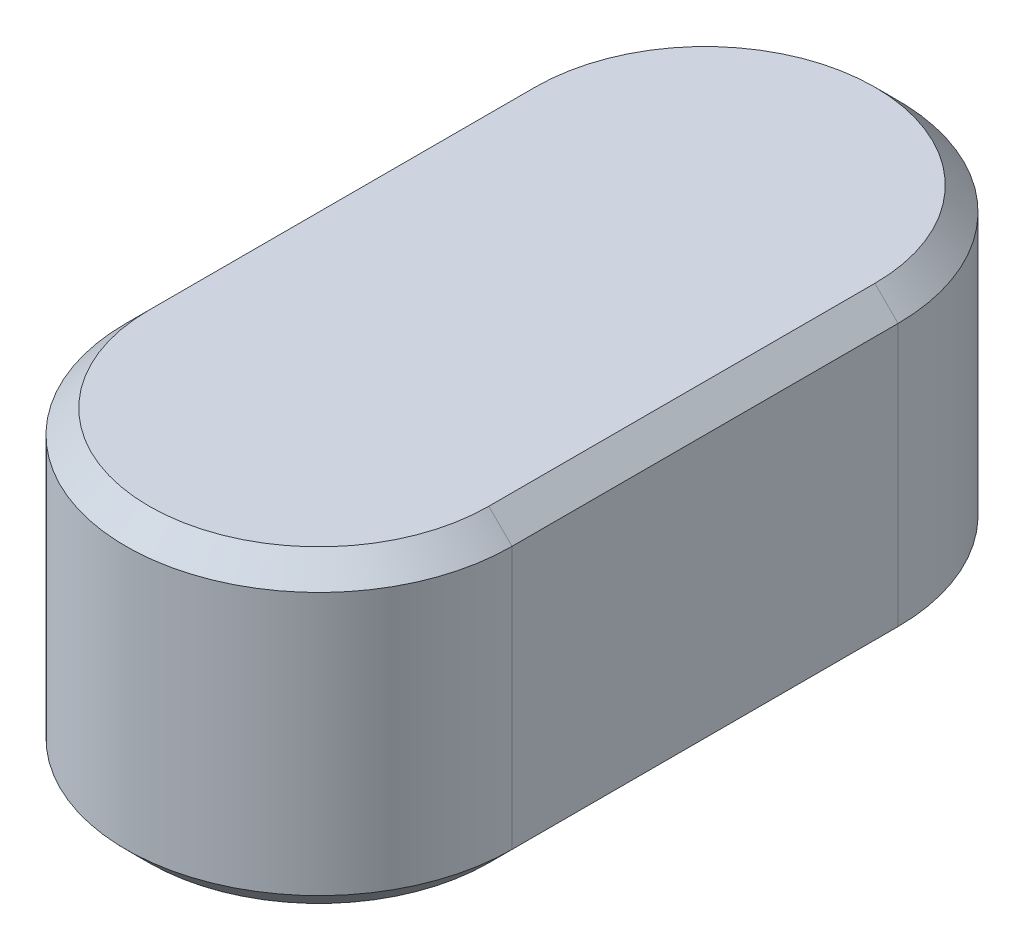
ISO-10303-21;
HEADER;
FILE_DESCRIPTION(('STEP AP214'),'2;1');
FILE_NAME('part.step','',(''),(''),'','','');
FILE_SCHEMA(('AUTOMOTIVE_DESIGN { 1 0 10303 214 1 1 1 1 }'));
ENDSEC;
DATA;
#1=APPLICATION_CONTEXT('core data for automotive mechanical design processes');
#2=APPLICATION_PROTOCOL_DEFINITION('international standard','automotive_design',2000,#1);
#3=PRODUCT_CONTEXT('',#1,'mechanical');
#4=PRODUCT('Part','Part','',(#3));
#5=PRODUCT_RELATED_PRODUCT_CATEGORY('part','',(#4));
#6=PRODUCT_DEFINITION_FORMATION('','',#4);
#7=PRODUCT_DEFINITION_CONTEXT('part definition',#1,'design');
#8=PRODUCT_DEFINITION('design','',#6,#7);
#9=PRODUCT_DEFINITION_SHAPE('','',#8);
#10=(LENGTH_UNIT() NAMED_UNIT(*) SI_UNIT(.MILLI.,.METRE.));
#11=(NAMED_UNIT(*) PLANE_ANGLE_UNIT() SI_UNIT($,.RADIAN.));
#12=(NAMED_UNIT(*) SI_UNIT($,.STERADIAN.) SOLID_ANGLE_UNIT());
#13=UNCERTAINTY_MEASURE_WITH_UNIT(LENGTH_MEASURE(1.E-05),#10,'distance_accuracy_value','');
#14=(GEOMETRIC_REPRESENTATION_CONTEXT(3) GLOBAL_UNCERTAINTY_ASSIGNED_CONTEXT((#13)) GLOBAL_UNIT_ASSIGNED_CONTEXT((#10,
#11,#12)) REPRESENTATION_CONTEXT('',''));
#15=CARTESIAN_POINT('',(0.,0.,0.));
#16=DIRECTION('',(0.,0.,1.));
#17=DIRECTION('',(1.,0.,0.));
#18=AXIS2_PLACEMENT_3D('',#15,#16,#17);
#19=CARTESIAN_POINT('',(0.,8.,0.));
#20=DIRECTION('',(0.,-1.,0.));
#21=DIRECTION('',(0.,0.,-1.));
#22=AXIS2_PLACEMENT_3D('',#19,#20,#21);
#23=CYLINDRICAL_SURFACE('',#22,5.);
#24=DIRECTION('',(0.,-1.,0.));
#25=VECTOR('',#24,1.);
#26=CARTESIAN_POINT('',(-5.,8.,0.));
#27=LINE('',#26,#25);
#28=CARTESIAN_POINT('',(-5.,7.4,0.));
#29=VERTEX_POINT('',#28);
#30=CARTESIAN_POINT('',(-5.,0.600000000000007,0.));
#31=VERTEX_POINT('',#30);
#32=EDGE_CURVE('E119',#29,#31,#27,.T.);
#33=ORIENTED_EDGE('',*,*,#32,.T.);
#34=CARTESIAN_POINT('',(0.,0.600000000000007,0.));
#35=DIRECTION('',(0.,-1.,0.));
#36=DIRECTION('',(0.,0.,-1.));
#37=AXIS2_PLACEMENT_3D('',#34,#35,#36);
#38=CIRCLE('',#37,5.);
#39=CARTESIAN_POINT('',(5.,0.600000000000007,0.));
#40=VERTEX_POINT('',#39);
#41=EDGE_CURVE('E126',#31,#40,#38,.F.);
#42=ORIENTED_EDGE('',*,*,#41,.T.);
#43=DIRECTION('',(0.,-1.,0.));
#44=VECTOR('',#43,1.);
#45=CARTESIAN_POINT('',(5.,8.,0.));
#46=LINE('',#45,#44);
#47=CARTESIAN_POINT('',(5.,7.4,0.));
#48=VERTEX_POINT('',#47);
#49=EDGE_CURVE('E121',#48,#40,#46,.T.);
#50=ORIENTED_EDGE('',*,*,#49,.F.);
#51=CARTESIAN_POINT('',(0.,7.4,0.));
#52=DIRECTION('',(0.,-1.,0.));
#53=DIRECTION('',(0.,0.,-1.));
#54=AXIS2_PLACEMENT_3D('',#51,#52,#53);
#55=CIRCLE('',#54,5.);
#56=EDGE_CURVE('E117',#48,#29,#55,.T.);
#57=ORIENTED_EDGE('',*,*,#56,.T.);
#58=EDGE_LOOP('',(#33,#42,#50,#57));
#59=FACE_BOUND('',#58,.T.);
#60=ADVANCED_FACE('F45',(#59),#23,.T.);
#61=CARTESIAN_POINT('',(5.,8.,0.));
#62=DIRECTION('',(-1.,0.,0.));
#63=DIRECTION('',(0.,0.,1.));
#64=AXIS2_PLACEMENT_3D('',#61,#62,#63);
#65=PLANE('',#64);
#66=ORIENTED_EDGE('',*,*,#49,.T.);
#67=DIRECTION('',(0.,0.,-1.));
#68=VECTOR('',#67,1.);
#69=CARTESIAN_POINT('',(5.,0.600000000000007,-10.));
#70=LINE('',#69,#68);
#71=CARTESIAN_POINT('',(5.,0.600000000000007,-10.));
#72=VERTEX_POINT('',#71);
#73=EDGE_CURVE('E192',#40,#72,#70,.T.);
#74=ORIENTED_EDGE('',*,*,#73,.T.);
#75=DIRECTION('',(0.,-1.,0.));
#76=VECTOR('',#75,1.);
#77=CARTESIAN_POINT('',(5.,8.,-10.));
#78=LINE('',#77,#76);
#79=CARTESIAN_POINT('',(5.,7.4,-10.));
#80=VERTEX_POINT('',#79);
#81=EDGE_CURVE('E233',#80,#72,#78,.T.);
#82=ORIENTED_EDGE('',*,*,#81,.F.);
#83=DIRECTION('',(0.,0.,1.));
#84=VECTOR('',#83,1.);
#85=CARTESIAN_POINT('',(5.,7.4,0.));
#86=LINE('',#85,#84);
#87=EDGE_CURVE('E214',#80,#48,#86,.T.);
#88=ORIENTED_EDGE('',*,*,#87,.T.);
#89=EDGE_LOOP('',(#66,#74,#82,#88));
#90=FACE_BOUND('',#89,.T.);
#91=ADVANCED_FACE('F235',(#90),#65,.F.);
#92=CARTESIAN_POINT('',(0.,8.,-10.));
#93=DIRECTION('',(0.,-1.,0.));
#94=DIRECTION('',(0.,0.,-1.));
#95=AXIS2_PLACEMENT_3D('',#92,#93,#94);
#96=CYLINDRICAL_SURFACE('',#95,5.);
#97=ORIENTED_EDGE('',*,*,#81,.T.);
#98=CARTESIAN_POINT('',(0.,0.600000000000007,-10.));
#99=DIRECTION('',(0.,-1.,0.));
#100=DIRECTION('',(0.,0.,-1.));
#101=AXIS2_PLACEMENT_3D('',#98,#99,#100);
#102=CIRCLE('',#101,5.);
#103=CARTESIAN_POINT('',(-5.,0.600000000000007,-10.));
#104=VERTEX_POINT('',#103);
#105=EDGE_CURVE('E187',#72,#104,#102,.F.);
#106=ORIENTED_EDGE('',*,*,#105,.T.);
#107=DIRECTION('',(0.,-1.,0.));
#108=VECTOR('',#107,1.);
#109=CARTESIAN_POINT('',(-5.,8.,-10.));
#110=LINE('',#109,#108);
#111=CARTESIAN_POINT('',(-5.,7.4,-10.));
#112=VERTEX_POINT('',#111);
#113=EDGE_CURVE('E139',#112,#104,#110,.T.);
#114=ORIENTED_EDGE('',*,*,#113,.F.);
#115=CARTESIAN_POINT('',(0.,7.4,-10.));
#116=DIRECTION('',(0.,-1.,0.));
#117=DIRECTION('',(0.,0.,-1.));
#118=AXIS2_PLACEMENT_3D('',#115,#116,#117);
#119=CIRCLE('',#118,5.);
#120=EDGE_CURVE('E209',#112,#80,#119,.T.);
#121=ORIENTED_EDGE('',*,*,#120,.T.);
#122=EDGE_LOOP('',(#97,#106,#114,#121));
#123=FACE_BOUND('',#122,.T.);
#124=ADVANCED_FACE('F232',(#123),#96,.T.);
#125=CARTESIAN_POINT('',(-5.,8.,0.));
#126=DIRECTION('',(1.,0.,0.));
#127=DIRECTION('',(0.,0.,-1.));
#128=AXIS2_PLACEMENT_3D('',#125,#126,#127);
#129=PLANE('',#128);
#130=ORIENTED_EDGE('',*,*,#113,.T.);
#131=DIRECTION('',(0.,0.,1.));
#132=VECTOR('',#131,1.);
#133=CARTESIAN_POINT('',(-5.,0.600000000000007,0.));
#134=LINE('',#133,#132);
#135=EDGE_CURVE('E137',#104,#31,#134,.T.);
#136=ORIENTED_EDGE('',*,*,#135,.T.);
#137=ORIENTED_EDGE('',*,*,#32,.F.);
#138=DIRECTION('',(0.,0.,-1.));
#139=VECTOR('',#138,1.);
#140=CARTESIAN_POINT('',(-5.,7.4,0.));
#141=LINE('',#140,#139);
#142=EDGE_CURVE('E134',#29,#112,#141,.T.);
#143=ORIENTED_EDGE('',*,*,#142,.T.);
#144=EDGE_LOOP('',(#130,#136,#137,#143));
#145=FACE_BOUND('',#144,.T.);
#146=ADVANCED_FACE('F133',(#145),#129,.F.);
#147=CARTESIAN_POINT('',(0.,8.,0.));
#148=DIRECTION('',(0.,-1.,0.));
#149=DIRECTION('',(0.,0.,-1.));
#150=AXIS2_PLACEMENT_3D('',#147,#148,#149);
#151=PLANE('',#150);
#152=CARTESIAN_POINT('',(0.,8.,-10.));
#153=DIRECTION('',(0.,-1.,0.));
#154=DIRECTION('',(0.,0.,-1.));
#155=AXIS2_PLACEMENT_3D('',#152,#153,#154);
#156=CIRCLE('',#155,4.4);
#157=CARTESIAN_POINT('',(4.4,8.,-10.));
#158=VERTEX_POINT('',#157);
#159=CARTESIAN_POINT('',(-4.4,8.,-10.));
#160=VERTEX_POINT('',#159);
#161=EDGE_CURVE('E71',#158,#160,#156,.F.);
#162=ORIENTED_EDGE('',*,*,#161,.T.);
#163=DIRECTION('',(0.,0.,1.));
#164=VECTOR('',#163,1.);
#165=CARTESIAN_POINT('',(-4.4,8.,0.));
#166=LINE('',#165,#164);
#167=CARTESIAN_POINT('',(-4.4,8.,0.));
#168=VERTEX_POINT('',#167);
#169=EDGE_CURVE('E11',#160,#168,#166,.T.);
#170=ORIENTED_EDGE('',*,*,#169,.T.);
#171=CARTESIAN_POINT('',(0.,8.,0.));
#172=DIRECTION('',(0.,-1.,0.));
#173=DIRECTION('',(0.,0.,-1.));
#174=AXIS2_PLACEMENT_3D('',#171,#172,#173);
#175=CIRCLE('',#174,4.4);
#176=CARTESIAN_POINT('',(4.4,8.,0.));
#177=VERTEX_POINT('',#176);
#178=EDGE_CURVE('E56',#168,#177,#175,.F.);
#179=ORIENTED_EDGE('',*,*,#178,.T.);
#180=DIRECTION('',(0.,0.,-1.));
#181=VECTOR('',#180,1.);
#182=CARTESIAN_POINT('',(4.4,8.,0.));
#183=LINE('',#182,#181);
#184=EDGE_CURVE('E219',#177,#158,#183,.T.);
#185=ORIENTED_EDGE('',*,*,#184,.T.);
#186=EDGE_LOOP('',(#162,#170,#179,#185));
#187=FACE_BOUND('',#186,.T.);
#188=ADVANCED_FACE('F225',(#187),#151,.F.);
#189=CARTESIAN_POINT('',(0.,0.,0.));
#190=DIRECTION('',(0.,-1.,0.));
#191=DIRECTION('',(0.,0.,-1.));
#192=AXIS2_PLACEMENT_3D('',#189,#190,#191);
#193=PLANE('',#192);
#194=CARTESIAN_POINT('',(0.,0.,0.));
#195=DIRECTION('',(0.,-1.,0.));
#196=DIRECTION('',(0.,0.,-1.));
#197=AXIS2_PLACEMENT_3D('',#194,#195,#196);
#198=CIRCLE('',#197,4.39999999999999);
#199=CARTESIAN_POINT('',(4.39999999999999,0.,0.));
#200=VERTEX_POINT('',#199);
#201=CARTESIAN_POINT('',(-4.39999999999999,0.,0.));
#202=VERTEX_POINT('',#201);
#203=EDGE_CURVE('E199',#200,#202,#198,.T.);
#204=ORIENTED_EDGE('',*,*,#203,.T.);
#205=DIRECTION('',(0.,0.,-1.));
#206=VECTOR('',#205,1.);
#207=CARTESIAN_POINT('',(-4.39999999999999,0.,-10.));
#208=LINE('',#207,#206);
#209=CARTESIAN_POINT('',(-4.39999999999999,0.,-10.));
#210=VERTEX_POINT('',#209);
#211=EDGE_CURVE('E127',#202,#210,#208,.T.);
#212=ORIENTED_EDGE('',*,*,#211,.T.);
#213=CARTESIAN_POINT('',(0.,0.,-10.));
#214=DIRECTION('',(0.,-1.,0.));
#215=DIRECTION('',(0.,0.,-1.));
#216=AXIS2_PLACEMENT_3D('',#213,#214,#215);
#217=CIRCLE('',#216,4.39999999999999);
#218=CARTESIAN_POINT('',(4.39999999999999,0.,-10.));
#219=VERTEX_POINT('',#218);
#220=EDGE_CURVE('E185',#210,#219,#217,.T.);
#221=ORIENTED_EDGE('',*,*,#220,.T.);
#222=DIRECTION('',(0.,0.,1.));
#223=VECTOR('',#222,1.);
#224=CARTESIAN_POINT('',(4.39999999999999,0.,0.));
#225=LINE('',#224,#223);
#226=EDGE_CURVE('E193',#219,#200,#225,.T.);
#227=ORIENTED_EDGE('',*,*,#226,.T.);
#228=EDGE_LOOP('',(#204,#212,#221,#227));
#229=FACE_BOUND('',#228,.T.);
#230=ADVANCED_FACE('F263',(#229),#193,.T.);
#231=CARTESIAN_POINT('',(5.,0.600000000000007,0.));
#232=DIRECTION('',(0.707106781186547,-0.707106781186547,0.));
#233=DIRECTION('',(0.,0.,1.));
#234=AXIS2_PLACEMENT_3D('',#231,#232,#233);
#235=PLANE('',#234);
#236=DIRECTION('',(0.707106781186547,0.707106781186547,0.));
#237=VECTOR('',#236,1.);
#238=CARTESIAN_POINT('',(4.39999999999999,0.,0.));
#239=LINE('',#238,#237);
#240=EDGE_CURVE('E169',#200,#40,#239,.T.);
#241=ORIENTED_EDGE('',*,*,#240,.F.);
#242=ORIENTED_EDGE('',*,*,#226,.F.);
#243=DIRECTION('',(-0.707106781186547,-0.707106781186547,0.));
#244=VECTOR('',#243,1.);
#245=CARTESIAN_POINT('',(5.,0.600000000000007,-10.));
#246=LINE('',#245,#244);
#247=EDGE_CURVE('E140',#72,#219,#246,.T.);
#248=ORIENTED_EDGE('',*,*,#247,.F.);
#249=ORIENTED_EDGE('',*,*,#73,.F.);
#250=EDGE_LOOP('',(#241,#242,#248,#249));
#251=FACE_BOUND('',#250,.T.);
#252=ADVANCED_FACE('F191',(#251),#235,.T.);
#253=CARTESIAN_POINT('',(0.,0.600000000000007,-10.));
#254=DIRECTION('',(0.,1.,0.));
#255=DIRECTION('',(0.,0.,1.));
#256=AXIS2_PLACEMENT_3D('',#253,#254,#255);
#257=CONICAL_SURFACE('',#256,5.,0.785398163397448);
#258=ORIENTED_EDGE('',*,*,#247,.T.);
#259=ORIENTED_EDGE('',*,*,#220,.F.);
#260=DIRECTION('',(0.707106781186547,-0.707106781186547,0.));
#261=VECTOR('',#260,1.);
#262=CARTESIAN_POINT('',(-5.,0.600000000000007,-10.));
#263=LINE('',#262,#261);
#264=EDGE_CURVE('E162',#104,#210,#263,.T.);
#265=ORIENTED_EDGE('',*,*,#264,.F.);
#266=ORIENTED_EDGE('',*,*,#105,.F.);
#267=EDGE_LOOP('',(#258,#259,#265,#266));
#268=FACE_BOUND('',#267,.T.);
#269=ADVANCED_FACE('F183',(#268),#257,.T.);
#270=CARTESIAN_POINT('',(0.,0.600000000000007,0.));
#271=DIRECTION('',(0.,1.,0.));
#272=DIRECTION('',(0.,0.,1.));
#273=AXIS2_PLACEMENT_3D('',#270,#271,#272);
#274=CONICAL_SURFACE('',#273,5.,0.785398163397448);
#275=ORIENTED_EDGE('',*,*,#240,.T.);
#276=ORIENTED_EDGE('',*,*,#41,.F.);
#277=DIRECTION('',(-0.707106781186547,0.707106781186547,0.));
#278=VECTOR('',#277,1.);
#279=CARTESIAN_POINT('',(-4.39999999999999,0.,0.));
#280=LINE('',#279,#278);
#281=EDGE_CURVE('E158',#202,#31,#280,.T.);
#282=ORIENTED_EDGE('',*,*,#281,.F.);
#283=ORIENTED_EDGE('',*,*,#203,.F.);
#284=EDGE_LOOP('',(#275,#276,#282,#283));
#285=FACE_BOUND('',#284,.T.);
#286=ADVANCED_FACE('F244',(#285),#274,.T.);
#287=CARTESIAN_POINT('',(-5.,0.600000000000007,0.));
#288=DIRECTION('',(-0.707106781186547,-0.707106781186547,0.));
#289=DIRECTION('',(0.,0.,-1.));
#290=AXIS2_PLACEMENT_3D('',#287,#288,#289);
#291=PLANE('',#290);
#292=ORIENTED_EDGE('',*,*,#264,.T.);
#293=ORIENTED_EDGE('',*,*,#211,.F.);
#294=ORIENTED_EDGE('',*,*,#281,.T.);
#295=ORIENTED_EDGE('',*,*,#135,.F.);
#296=EDGE_LOOP('',(#292,#293,#294,#295));
#297=FACE_BOUND('',#296,.T.);
#298=ADVANCED_FACE('F242',(#297),#291,.T.);
#299=CARTESIAN_POINT('',(4.4,8.,0.));
#300=DIRECTION('',(-0.707106781186548,-0.707106781186548,0.));
#301=DIRECTION('',(0.,0.,-1.));
#302=AXIS2_PLACEMENT_3D('',#299,#300,#301);
#303=PLANE('',#302);
#304=DIRECTION('',(-0.707106781186548,0.707106781186548,0.));
#305=VECTOR('',#304,1.);
#306=CARTESIAN_POINT('',(5.,7.4,0.));
#307=LINE('',#306,#305);
#308=EDGE_CURVE('E151',#48,#177,#307,.T.);
#309=ORIENTED_EDGE('',*,*,#308,.F.);
#310=ORIENTED_EDGE('',*,*,#87,.F.);
#311=DIRECTION('',(0.707106781186548,-0.707106781186548,0.));
#312=VECTOR('',#311,1.);
#313=CARTESIAN_POINT('',(4.4,8.,-10.));
#314=LINE('',#313,#312);
#315=EDGE_CURVE('E50',#158,#80,#314,.T.);
#316=ORIENTED_EDGE('',*,*,#315,.F.);
#317=ORIENTED_EDGE('',*,*,#184,.F.);
#318=EDGE_LOOP('',(#309,#310,#316,#317));
#319=FACE_BOUND('',#318,.T.);
#320=ADVANCED_FACE('F48',(#319),#303,.F.);
#321=CARTESIAN_POINT('',(0.,8.,-10.));
#322=DIRECTION('',(0.,-1.,0.));
#323=DIRECTION('',(0.,0.,-1.));
#324=AXIS2_PLACEMENT_3D('',#321,#322,#323);
#325=CONICAL_SURFACE('',#324,4.4,0.785398163397448);
#326=ORIENTED_EDGE('',*,*,#315,.T.);
#327=ORIENTED_EDGE('',*,*,#120,.F.);
#328=DIRECTION('',(-0.707106781186548,-0.707106781186548,0.));
#329=VECTOR('',#328,1.);
#330=CARTESIAN_POINT('',(-4.4,8.,-10.));
#331=LINE('',#330,#329);
#332=EDGE_CURVE('E143',#160,#112,#331,.T.);
#333=ORIENTED_EDGE('',*,*,#332,.F.);
#334=ORIENTED_EDGE('',*,*,#161,.F.);
#335=EDGE_LOOP('',(#326,#327,#333,#334));
#336=FACE_BOUND('',#335,.T.);
#337=ADVANCED_FACE('F228',(#336),#325,.T.);
#338=CARTESIAN_POINT('',(0.,8.,0.));
#339=DIRECTION('',(0.,-1.,0.));
#340=DIRECTION('',(0.,0.,-1.));
#341=AXIS2_PLACEMENT_3D('',#338,#339,#340);
#342=CONICAL_SURFACE('',#341,4.4,0.785398163397448);
#343=ORIENTED_EDGE('',*,*,#308,.T.);
#344=ORIENTED_EDGE('',*,*,#178,.F.);
#345=DIRECTION('',(0.707106781186548,0.707106781186548,0.));
#346=VECTOR('',#345,1.);
#347=CARTESIAN_POINT('',(-5.,7.4,0.));
#348=LINE('',#347,#346);
#349=EDGE_CURVE('E64',#29,#168,#348,.T.);
#350=ORIENTED_EDGE('',*,*,#349,.F.);
#351=ORIENTED_EDGE('',*,*,#56,.F.);
#352=EDGE_LOOP('',(#343,#344,#350,#351));
#353=FACE_BOUND('',#352,.T.);
#354=ADVANCED_FACE('F147',(#353),#342,.T.);
#355=CARTESIAN_POINT('',(-4.4,8.,0.));
#356=DIRECTION('',(0.707106781186548,-0.707106781186548,0.));
#357=DIRECTION('',(0.,0.,1.));
#358=AXIS2_PLACEMENT_3D('',#355,#356,#357);
#359=PLANE('',#358);
#360=ORIENTED_EDGE('',*,*,#332,.T.);
#361=ORIENTED_EDGE('',*,*,#142,.F.);
#362=ORIENTED_EDGE('',*,*,#349,.T.);
#363=ORIENTED_EDGE('',*,*,#169,.F.);
#364=EDGE_LOOP('',(#360,#361,#362,#363));
#365=FACE_BOUND('',#364,.T.);
#366=ADVANCED_FACE('F142',(#365),#359,.F.);
#367=CLOSED_SHELL('',(#60,#91,#124,#146,#188,#230,#252,#269,#286,#298,#320,#337,#354,#366));
#368=MANIFOLD_SOLID_BREP('B2',#367);
#369=ADVANCED_BREP_SHAPE_REPRESENTATION('',(#18,#368),#14);
#370=SHAPE_DEFINITION_REPRESENTATION(#9,#369);
ENDSEC;
END-ISO-10303-21;
